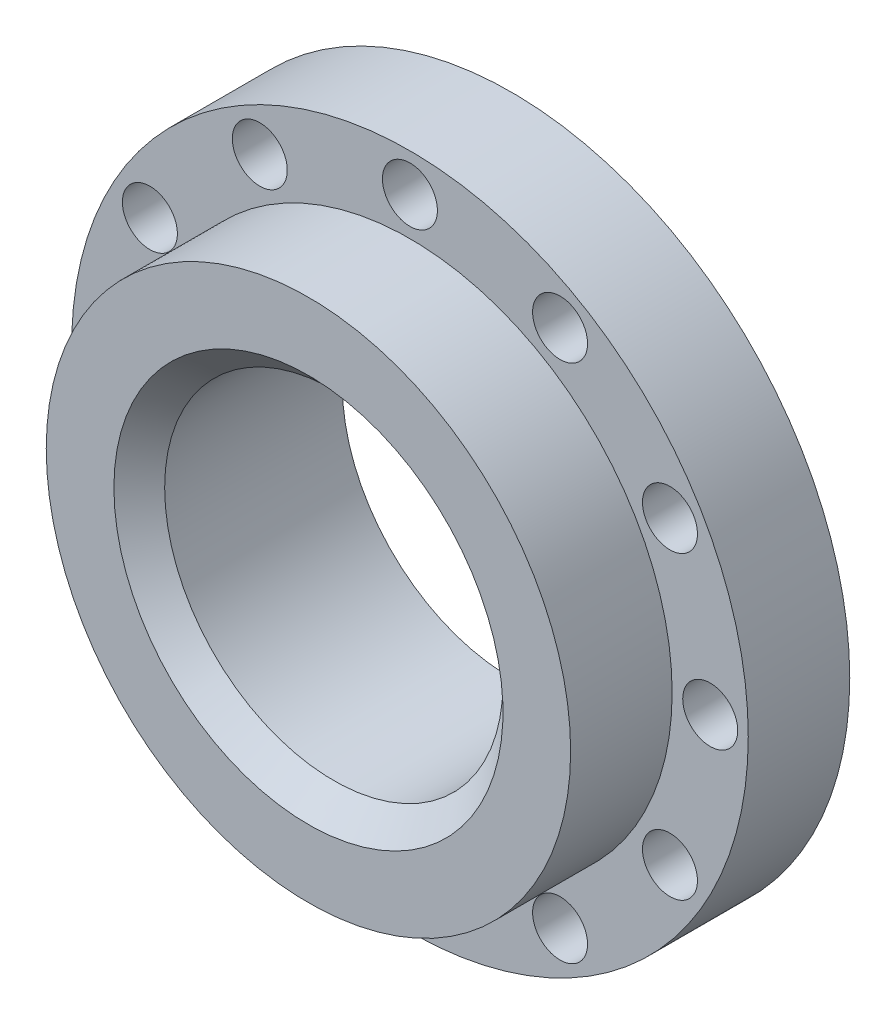
ISO-10303-21;
HEADER;
FILE_DESCRIPTION(('STEP AP214'),'2;1');
FILE_NAME('part.step','',(''),(''),'','','');
FILE_SCHEMA(('AUTOMOTIVE_DESIGN { 1 0 10303 214 1 1 1 1 }'));
ENDSEC;
DATA;
#1=APPLICATION_CONTEXT('core data for automotive mechanical design processes');
#2=APPLICATION_PROTOCOL_DEFINITION('international standard','automotive_design',2000,#1);
#3=PRODUCT_CONTEXT('',#1,'mechanical');
#4=PRODUCT('Part','Part','',(#3));
#5=PRODUCT_RELATED_PRODUCT_CATEGORY('part','',(#4));
#6=PRODUCT_DEFINITION_FORMATION('','',#4);
#7=PRODUCT_DEFINITION_CONTEXT('part definition',#1,'design');
#8=PRODUCT_DEFINITION('design','',#6,#7);
#9=PRODUCT_DEFINITION_SHAPE('','',#8);
#10=(LENGTH_UNIT() NAMED_UNIT(*) SI_UNIT(.MILLI.,.METRE.));
#11=(NAMED_UNIT(*) PLANE_ANGLE_UNIT() SI_UNIT($,.RADIAN.));
#12=(NAMED_UNIT(*) SI_UNIT($,.STERADIAN.) SOLID_ANGLE_UNIT());
#13=UNCERTAINTY_MEASURE_WITH_UNIT(LENGTH_MEASURE(1.E-05),#10,'distance_accuracy_value','');
#14=(GEOMETRIC_REPRESENTATION_CONTEXT(3) GLOBAL_UNCERTAINTY_ASSIGNED_CONTEXT((#13)) GLOBAL_UNIT_ASSIGNED_CONTEXT((#10,
#11,#12)) REPRESENTATION_CONTEXT('',''));
#15=CARTESIAN_POINT('',(0.,0.,0.));
#16=DIRECTION('',(0.,0.,1.));
#17=DIRECTION('',(1.,0.,0.));
#18=AXIS2_PLACEMENT_3D('',#15,#16,#17);
#19=CARTESIAN_POINT('',(0.,0.,-331.));
#20=DIRECTION('',(0.,0.,-1.));
#21=DIRECTION('',(-1.,0.,0.));
#22=AXIS2_PLACEMENT_3D('',#19,#20,#21);
#23=PLANE('',#22);
#24=CARTESIAN_POINT('',(30.7439018343476,17.7499999999999,-331.));
#25=DIRECTION('',(0.,0.,-1.));
#26=DIRECTION('',(-1.,0.,0.));
#27=AXIS2_PLACEMENT_3D('',#24,#25,#26);
#28=CIRCLE('',#27,3.24999999999999);
#29=CARTESIAN_POINT('',(27.4939018343476,17.7499999999999,-331.));
#30=VERTEX_POINT('',#29);
#31=EDGE_CURVE('E72',#30,#30,#28,.T.);
#32=ORIENTED_EDGE('',*,*,#31,.F.);
#33=EDGE_LOOP('',(#32));
#34=FACE_BOUND('',#33,.T.);
#35=CARTESIAN_POINT('',(35.5,-1.11022302462516E-13,-331.));
#36=DIRECTION('',(0.,0.,-1.));
#37=DIRECTION('',(-1.,0.,0.));
#38=AXIS2_PLACEMENT_3D('',#35,#36,#37);
#39=CIRCLE('',#38,3.24999999999999);
#40=CARTESIAN_POINT('',(32.25,-1.11022302462516E-13,-331.));
#41=VERTEX_POINT('',#40);
#42=EDGE_CURVE('E64',#41,#41,#39,.T.);
#43=ORIENTED_EDGE('',*,*,#42,.F.);
#44=EDGE_LOOP('',(#43));
#45=FACE_BOUND('',#44,.T.);
#46=CARTESIAN_POINT('',(30.7439018343475,-17.7500000000002,-331.));
#47=DIRECTION('',(0.,0.,-1.));
#48=DIRECTION('',(-1.,0.,0.));
#49=AXIS2_PLACEMENT_3D('',#46,#47,#48);
#50=CIRCLE('',#49,3.24999999999999);
#51=CARTESIAN_POINT('',(27.4939018343475,-17.7500000000002,-331.));
#52=VERTEX_POINT('',#51);
#53=EDGE_CURVE('E71',#52,#52,#50,.T.);
#54=ORIENTED_EDGE('',*,*,#53,.F.);
#55=EDGE_LOOP('',(#54));
#56=FACE_BOUND('',#55,.T.);
#57=CARTESIAN_POINT('',(17.7499999999998,-30.7439018343477,-331.));
#58=DIRECTION('',(0.,0.,-1.));
#59=DIRECTION('',(-1.,0.,0.));
#60=AXIS2_PLACEMENT_3D('',#57,#58,#59);
#61=CIRCLE('',#60,3.24999999999999);
#62=CARTESIAN_POINT('',(14.4999999999998,-30.7439018343477,-331.));
#63=VERTEX_POINT('',#62);
#64=EDGE_CURVE('E56',#63,#63,#61,.T.);
#65=ORIENTED_EDGE('',*,*,#64,.F.);
#66=EDGE_LOOP('',(#65));
#67=FACE_BOUND('',#66,.T.);
#68=CARTESIAN_POINT('',(0.,-35.5,-331.));
#69=DIRECTION('',(0.,0.,-1.));
#70=DIRECTION('',(-1.,0.,0.));
#71=AXIS2_PLACEMENT_3D('',#68,#69,#70);
#72=CIRCLE('',#71,3.24999999999999);
#73=CARTESIAN_POINT('',(-3.24999999999999,-35.5,-331.));
#74=VERTEX_POINT('',#73);
#75=EDGE_CURVE('E63',#74,#74,#72,.T.);
#76=ORIENTED_EDGE('',*,*,#75,.F.);
#77=EDGE_LOOP('',(#76));
#78=FACE_BOUND('',#77,.T.);
#79=CARTESIAN_POINT('',(-17.7500000000003,-30.7439018343474,-331.));
#80=DIRECTION('',(0.,0.,-1.));
#81=DIRECTION('',(-1.,0.,0.));
#82=AXIS2_PLACEMENT_3D('',#79,#80,#81);
#83=CIRCLE('',#82,3.24999999999999);
#84=CARTESIAN_POINT('',(-21.0000000000003,-30.7439018343474,-331.));
#85=VERTEX_POINT('',#84);
#86=EDGE_CURVE('E115',#85,#85,#83,.T.);
#87=ORIENTED_EDGE('',*,*,#86,.F.);
#88=EDGE_LOOP('',(#87));
#89=FACE_BOUND('',#88,.T.);
#90=CARTESIAN_POINT('',(-30.7439018343477,-17.7499999999997,-331.));
#91=DIRECTION('',(0.,0.,-1.));
#92=DIRECTION('',(-1.,0.,0.));
#93=AXIS2_PLACEMENT_3D('',#90,#91,#92);
#94=CIRCLE('',#93,3.24999999999999);
#95=CARTESIAN_POINT('',(-33.9939018343477,-17.7499999999997,-331.));
#96=VERTEX_POINT('',#95);
#97=EDGE_CURVE('E109',#96,#96,#94,.T.);
#98=ORIENTED_EDGE('',*,*,#97,.F.);
#99=EDGE_LOOP('',(#98));
#100=FACE_BOUND('',#99,.T.);
#101=CARTESIAN_POINT('',(-35.5,3.33066907387547E-13,-331.));
#102=DIRECTION('',(0.,0.,-1.));
#103=DIRECTION('',(-1.,0.,0.));
#104=AXIS2_PLACEMENT_3D('',#101,#102,#103);
#105=CIRCLE('',#104,3.24999999999999);
#106=CARTESIAN_POINT('',(-38.75,3.33066907387547E-13,-331.));
#107=VERTEX_POINT('',#106);
#108=EDGE_CURVE('E103',#107,#107,#105,.T.);
#109=ORIENTED_EDGE('',*,*,#108,.F.);
#110=EDGE_LOOP('',(#109));
#111=FACE_BOUND('',#110,.T.);
#112=CARTESIAN_POINT('',(-30.7439018343474,17.7500000000004,-331.));
#113=DIRECTION('',(0.,0.,-1.));
#114=DIRECTION('',(-1.,0.,0.));
#115=AXIS2_PLACEMENT_3D('',#112,#113,#114);
#116=CIRCLE('',#115,3.24999999999999);
#117=CARTESIAN_POINT('',(-33.9939018343474,17.7500000000004,-331.));
#118=VERTEX_POINT('',#117);
#119=EDGE_CURVE('E97',#118,#118,#116,.T.);
#120=ORIENTED_EDGE('',*,*,#119,.F.);
#121=EDGE_LOOP('',(#120));
#122=FACE_BOUND('',#121,.T.);
#123=CARTESIAN_POINT('',(-17.7499999999996,30.7439018343478,-331.));
#124=DIRECTION('',(0.,0.,-1.));
#125=DIRECTION('',(-1.,0.,0.));
#126=AXIS2_PLACEMENT_3D('',#123,#124,#125);
#127=CIRCLE('',#126,3.24999999999999);
#128=CARTESIAN_POINT('',(-20.9999999999996,30.7439018343478,-331.));
#129=VERTEX_POINT('',#128);
#130=EDGE_CURVE('E90',#129,#129,#127,.T.);
#131=ORIENTED_EDGE('',*,*,#130,.F.);
#132=EDGE_LOOP('',(#131));
#133=FACE_BOUND('',#132,.T.);
#134=CARTESIAN_POINT('',(17.75,30.7439018343476,-331.));
#135=DIRECTION('',(0.,0.,-1.));
#136=DIRECTION('',(-1.,0.,0.));
#137=AXIS2_PLACEMENT_3D('',#134,#135,#136);
#138=CIRCLE('',#137,3.24999999999999);
#139=CARTESIAN_POINT('',(14.5,30.7439018343476,-331.));
#140=VERTEX_POINT('',#139);
#141=EDGE_CURVE('E78',#140,#140,#138,.T.);
#142=ORIENTED_EDGE('',*,*,#141,.F.);
#143=EDGE_LOOP('',(#142));
#144=FACE_BOUND('',#143,.T.);
#145=CARTESIAN_POINT('',(0.,35.5,-331.));
#146=DIRECTION('',(0.,0.,-1.));
#147=DIRECTION('',(-1.,0.,0.));
#148=AXIS2_PLACEMENT_3D('',#145,#146,#147);
#149=CIRCLE('',#148,3.24999999999999);
#150=CARTESIAN_POINT('',(-3.24999999999999,35.5,-331.));
#151=VERTEX_POINT('',#150);
#152=EDGE_CURVE('E81',#151,#151,#149,.T.);
#153=ORIENTED_EDGE('',*,*,#152,.F.);
#154=EDGE_LOOP('',(#153));
#155=FACE_BOUND('',#154,.T.);
#156=CARTESIAN_POINT('',(0.,0.,-331.));
#157=DIRECTION('',(0.,0.,1.));
#158=DIRECTION('',(1.,0.,0.));
#159=AXIS2_PLACEMENT_3D('',#156,#157,#158);
#160=CIRCLE('',#159,19.9999999999999);
#161=CARTESIAN_POINT('',(19.9999999999999,0.,-331.));
#162=VERTEX_POINT('',#161);
#163=EDGE_CURVE('E89',#162,#162,#160,.T.);
#164=ORIENTED_EDGE('',*,*,#163,.T.);
#165=EDGE_LOOP('',(#164));
#166=FACE_BOUND('',#165,.T.);
#167=CARTESIAN_POINT('',(0.,0.,-331.));
#168=DIRECTION('',(0.,0.,1.));
#169=DIRECTION('',(1.,0.,0.));
#170=AXIS2_PLACEMENT_3D('',#167,#168,#169);
#171=CIRCLE('',#170,40.);
#172=CARTESIAN_POINT('',(40.,0.,-331.));
#173=VERTEX_POINT('',#172);
#174=EDGE_CURVE('E49',#173,#173,#171,.T.);
#175=ORIENTED_EDGE('',*,*,#174,.F.);
#176=EDGE_LOOP('',(#175));
#177=FACE_BOUND('',#176,.T.);
#178=ADVANCED_FACE('F38',(#34,#45,#56,#67,#78,#89,#100,#111,#122,#133,#144,#155,#166,#177),#23,.T.);
#179=CARTESIAN_POINT('',(0.,0.,0.));
#180=DIRECTION('',(0.,0.,1.));
#181=DIRECTION('',(1.,0.,0.));
#182=AXIS2_PLACEMENT_3D('',#179,#180,#181);
#183=CYLINDRICAL_SURFACE('',#182,40.);
#184=ORIENTED_EDGE('',*,*,#174,.T.);
#185=EDGE_LOOP('',(#184));
#186=FACE_BOUND('',#185,.T.);
#187=CARTESIAN_POINT('',(0.,0.,-319.));
#188=DIRECTION('',(0.,0.,1.));
#189=DIRECTION('',(1.,0.,0.));
#190=AXIS2_PLACEMENT_3D('',#187,#188,#189);
#191=CIRCLE('',#190,40.);
#192=CARTESIAN_POINT('',(40.,0.,-319.));
#193=VERTEX_POINT('',#192);
#194=EDGE_CURVE('E53',#193,#193,#191,.T.);
#195=ORIENTED_EDGE('',*,*,#194,.F.);
#196=EDGE_LOOP('',(#195));
#197=FACE_BOUND('',#196,.T.);
#198=ADVANCED_FACE('F157',(#186,#197),#183,.T.);
#199=CARTESIAN_POINT('',(0.,0.,-319.));
#200=DIRECTION('',(0.,0.,-1.));
#201=DIRECTION('',(-1.,0.,0.));
#202=AXIS2_PLACEMENT_3D('',#199,#200,#201);
#203=PLANE('',#202);
#204=CARTESIAN_POINT('',(30.7439018343476,17.7499999999999,-319.));
#205=DIRECTION('',(0.,0.,-1.));
#206=DIRECTION('',(-1.,0.,0.));
#207=AXIS2_PLACEMENT_3D('',#204,#205,#206);
#208=CIRCLE('',#207,3.24999999999999);
#209=CARTESIAN_POINT('',(27.4939018343476,17.7499999999999,-319.));
#210=VERTEX_POINT('',#209);
#211=EDGE_CURVE('E67',#210,#210,#208,.T.);
#212=ORIENTED_EDGE('',*,*,#211,.T.);
#213=EDGE_LOOP('',(#212));
#214=FACE_BOUND('',#213,.T.);
#215=CARTESIAN_POINT('',(35.5,-1.11022302462516E-13,-319.));
#216=DIRECTION('',(0.,0.,-1.));
#217=DIRECTION('',(-1.,0.,0.));
#218=AXIS2_PLACEMENT_3D('',#215,#216,#217);
#219=CIRCLE('',#218,3.24999999999999);
#220=CARTESIAN_POINT('',(32.25,-1.11022302462516E-13,-319.));
#221=VERTEX_POINT('',#220);
#222=EDGE_CURVE('E68',#221,#221,#219,.T.);
#223=ORIENTED_EDGE('',*,*,#222,.T.);
#224=EDGE_LOOP('',(#223));
#225=FACE_BOUND('',#224,.T.);
#226=CARTESIAN_POINT('',(30.7439018343475,-17.7500000000002,-319.));
#227=DIRECTION('',(0.,0.,-1.));
#228=DIRECTION('',(-1.,0.,0.));
#229=AXIS2_PLACEMENT_3D('',#226,#227,#228);
#230=CIRCLE('',#229,3.24999999999999);
#231=CARTESIAN_POINT('',(27.4939018343475,-17.7500000000002,-319.));
#232=VERTEX_POINT('',#231);
#233=EDGE_CURVE('E59',#232,#232,#230,.T.);
#234=ORIENTED_EDGE('',*,*,#233,.T.);
#235=EDGE_LOOP('',(#234));
#236=FACE_BOUND('',#235,.T.);
#237=CARTESIAN_POINT('',(17.7499999999998,-30.7439018343477,-319.));
#238=DIRECTION('',(0.,0.,-1.));
#239=DIRECTION('',(-1.,0.,0.));
#240=AXIS2_PLACEMENT_3D('',#237,#238,#239);
#241=CIRCLE('',#240,3.24999999999999);
#242=CARTESIAN_POINT('',(14.4999999999998,-30.7439018343477,-319.));
#243=VERTEX_POINT('',#242);
#244=EDGE_CURVE('E60',#243,#243,#241,.T.);
#245=ORIENTED_EDGE('',*,*,#244,.T.);
#246=EDGE_LOOP('',(#245));
#247=FACE_BOUND('',#246,.T.);
#248=CARTESIAN_POINT('',(0.,-35.5,-319.));
#249=DIRECTION('',(0.,0.,-1.));
#250=DIRECTION('',(-1.,0.,0.));
#251=AXIS2_PLACEMENT_3D('',#248,#249,#250);
#252=CIRCLE('',#251,3.24999999999999);
#253=CARTESIAN_POINT('',(-3.24999999999999,-35.5,-319.));
#254=VERTEX_POINT('',#253);
#255=EDGE_CURVE('E118',#254,#254,#252,.T.);
#256=ORIENTED_EDGE('',*,*,#255,.T.);
#257=EDGE_LOOP('',(#256));
#258=FACE_BOUND('',#257,.T.);
#259=CARTESIAN_POINT('',(-17.7500000000003,-30.7439018343474,-319.));
#260=DIRECTION('',(0.,0.,-1.));
#261=DIRECTION('',(-1.,0.,0.));
#262=AXIS2_PLACEMENT_3D('',#259,#260,#261);
#263=CIRCLE('',#262,3.24999999999999);
#264=CARTESIAN_POINT('',(-21.0000000000003,-30.7439018343474,-319.));
#265=VERTEX_POINT('',#264);
#266=EDGE_CURVE('E112',#265,#265,#263,.T.);
#267=ORIENTED_EDGE('',*,*,#266,.T.);
#268=EDGE_LOOP('',(#267));
#269=FACE_BOUND('',#268,.T.);
#270=CARTESIAN_POINT('',(-30.7439018343477,-17.7499999999997,-319.));
#271=DIRECTION('',(0.,0.,-1.));
#272=DIRECTION('',(-1.,0.,0.));
#273=AXIS2_PLACEMENT_3D('',#270,#271,#272);
#274=CIRCLE('',#273,3.24999999999999);
#275=CARTESIAN_POINT('',(-33.9939018343477,-17.7499999999997,-319.));
#276=VERTEX_POINT('',#275);
#277=EDGE_CURVE('E106',#276,#276,#274,.T.);
#278=ORIENTED_EDGE('',*,*,#277,.T.);
#279=EDGE_LOOP('',(#278));
#280=FACE_BOUND('',#279,.T.);
#281=CARTESIAN_POINT('',(-35.5,3.33066907387547E-13,-319.));
#282=DIRECTION('',(0.,0.,-1.));
#283=DIRECTION('',(-1.,0.,0.));
#284=AXIS2_PLACEMENT_3D('',#281,#282,#283);
#285=CIRCLE('',#284,3.24999999999999);
#286=CARTESIAN_POINT('',(-38.75,3.33066907387547E-13,-319.));
#287=VERTEX_POINT('',#286);
#288=EDGE_CURVE('E100',#287,#287,#285,.T.);
#289=ORIENTED_EDGE('',*,*,#288,.T.);
#290=EDGE_LOOP('',(#289));
#291=FACE_BOUND('',#290,.T.);
#292=CARTESIAN_POINT('',(-30.7439018343474,17.7500000000004,-319.));
#293=DIRECTION('',(0.,0.,-1.));
#294=DIRECTION('',(-1.,0.,0.));
#295=AXIS2_PLACEMENT_3D('',#292,#293,#294);
#296=CIRCLE('',#295,3.24999999999999);
#297=CARTESIAN_POINT('',(-33.9939018343474,17.7500000000004,-319.));
#298=VERTEX_POINT('',#297);
#299=EDGE_CURVE('E93',#298,#298,#296,.T.);
#300=ORIENTED_EDGE('',*,*,#299,.T.);
#301=EDGE_LOOP('',(#300));
#302=FACE_BOUND('',#301,.T.);
#303=CARTESIAN_POINT('',(-17.7499999999996,30.7439018343478,-319.));
#304=DIRECTION('',(0.,0.,-1.));
#305=DIRECTION('',(-1.,0.,0.));
#306=AXIS2_PLACEMENT_3D('',#303,#304,#305);
#307=CIRCLE('',#306,3.24999999999999);
#308=CARTESIAN_POINT('',(-20.9999999999996,30.7439018343478,-319.));
#309=VERTEX_POINT('',#308);
#310=EDGE_CURVE('E94',#309,#309,#307,.T.);
#311=ORIENTED_EDGE('',*,*,#310,.T.);
#312=EDGE_LOOP('',(#311));
#313=FACE_BOUND('',#312,.T.);
#314=CARTESIAN_POINT('',(17.75,30.7439018343476,-319.));
#315=DIRECTION('',(0.,0.,-1.));
#316=DIRECTION('',(-1.,0.,0.));
#317=AXIS2_PLACEMENT_3D('',#314,#315,#316);
#318=CIRCLE('',#317,3.24999999999999);
#319=CARTESIAN_POINT('',(14.5,30.7439018343476,-319.));
#320=VERTEX_POINT('',#319);
#321=EDGE_CURVE('E75',#320,#320,#318,.T.);
#322=ORIENTED_EDGE('',*,*,#321,.T.);
#323=EDGE_LOOP('',(#322));
#324=FACE_BOUND('',#323,.T.);
#325=CARTESIAN_POINT('',(0.,35.5,-319.));
#326=DIRECTION('',(0.,0.,-1.));
#327=DIRECTION('',(-1.,0.,0.));
#328=AXIS2_PLACEMENT_3D('',#325,#326,#327);
#329=CIRCLE('',#328,3.24999999999999);
#330=CARTESIAN_POINT('',(-3.24999999999999,35.5,-319.));
#331=VERTEX_POINT('',#330);
#332=EDGE_CURVE('E86',#331,#331,#329,.T.);
#333=ORIENTED_EDGE('',*,*,#332,.T.);
#334=EDGE_LOOP('',(#333));
#335=FACE_BOUND('',#334,.T.);
#336=CARTESIAN_POINT('',(0.,0.,-319.));
#337=DIRECTION('',(0.,0.,1.));
#338=DIRECTION('',(1.,0.,0.));
#339=AXIS2_PLACEMENT_3D('',#336,#337,#338);
#340=CIRCLE('',#339,31.);
#341=CARTESIAN_POINT('',(31.,0.,-319.));
#342=VERTEX_POINT('',#341);
#343=EDGE_CURVE('E131',#342,#342,#340,.T.);
#344=ORIENTED_EDGE('',*,*,#343,.F.);
#345=EDGE_LOOP('',(#344));
#346=FACE_BOUND('',#345,.T.);
#347=ORIENTED_EDGE('',*,*,#194,.T.);
#348=EDGE_LOOP('',(#347));
#349=FACE_BOUND('',#348,.T.);
#350=ADVANCED_FACE('F163',(#214,#225,#236,#247,#258,#269,#280,#291,#302,#313,#324,#335,#346,
#349),#203,.F.);
#351=CARTESIAN_POINT('',(0.,0.,0.));
#352=DIRECTION('',(0.,0.,1.));
#353=DIRECTION('',(1.,0.,0.));
#354=AXIS2_PLACEMENT_3D('',#351,#352,#353);
#355=CYLINDRICAL_SURFACE('',#354,31.);
#356=ORIENTED_EDGE('',*,*,#343,.T.);
#357=EDGE_LOOP('',(#356));
#358=FACE_BOUND('',#357,.T.);
#359=CARTESIAN_POINT('',(0.,0.,-307.));
#360=DIRECTION('',(0.,0.,1.));
#361=DIRECTION('',(1.,0.,0.));
#362=AXIS2_PLACEMENT_3D('',#359,#360,#361);
#363=CIRCLE('',#362,31.);
#364=CARTESIAN_POINT('',(31.,0.,-307.));
#365=VERTEX_POINT('',#364);
#366=EDGE_CURVE('E134',#365,#365,#363,.T.);
#367=ORIENTED_EDGE('',*,*,#366,.F.);
#368=EDGE_LOOP('',(#367));
#369=FACE_BOUND('',#368,.T.);
#370=ADVANCED_FACE('F154',(#358,#369),#355,.T.);
#371=CARTESIAN_POINT('',(0.,0.,-307.));
#372=DIRECTION('',(0.,0.,-1.));
#373=DIRECTION('',(-1.,0.,0.));
#374=AXIS2_PLACEMENT_3D('',#371,#372,#373);
#375=PLANE('',#374);
#376=CARTESIAN_POINT('',(0.,0.,-307.));
#377=DIRECTION('',(0.,0.,-1.));
#378=DIRECTION('',(-1.,0.,0.));
#379=AXIS2_PLACEMENT_3D('',#376,#377,#378);
#380=CIRCLE('',#379,22.9999999999999);
#381=CARTESIAN_POINT('',(-22.9999999999999,0.,-307.));
#382=VERTEX_POINT('',#381);
#383=EDGE_CURVE('E11',#382,#382,#380,.T.);
#384=ORIENTED_EDGE('',*,*,#383,.T.);
#385=EDGE_LOOP('',(#384));
#386=FACE_BOUND('',#385,.T.);
#387=ORIENTED_EDGE('',*,*,#366,.T.);
#388=EDGE_LOOP('',(#387));
#389=FACE_BOUND('',#388,.T.);
#390=ADVANCED_FACE('F145',(#386,#389),#375,.F.);
#391=CARTESIAN_POINT('',(0.,0.,0.));
#392=DIRECTION('',(0.,0.,1.));
#393=DIRECTION('',(1.,0.,0.));
#394=AXIS2_PLACEMENT_3D('',#391,#392,#393);
#395=CYLINDRICAL_SURFACE('',#394,19.9999999999999);
#396=CARTESIAN_POINT('',(0.,0.,-310.));
#397=DIRECTION('',(0.,0.,-1.));
#398=DIRECTION('',(-1.,0.,0.));
#399=AXIS2_PLACEMENT_3D('',#396,#397,#398);
#400=CIRCLE('',#399,19.9999999999999);
#401=CARTESIAN_POINT('',(-19.9999999999999,0.,-310.));
#402=VERTEX_POINT('',#401);
#403=EDGE_CURVE('E45',#402,#402,#400,.F.);
#404=ORIENTED_EDGE('',*,*,#403,.T.);
#405=EDGE_LOOP('',(#404));
#406=FACE_BOUND('',#405,.T.);
#407=ORIENTED_EDGE('',*,*,#163,.F.);
#408=EDGE_LOOP('',(#407));
#409=FACE_BOUND('',#408,.T.);
#410=ADVANCED_FACE('F142',(#406,#409),#395,.F.);
#411=CARTESIAN_POINT('',(0.,35.5,-331.));
#412=DIRECTION('',(0.,0.,-1.));
#413=DIRECTION('',(-1.,0.,0.));
#414=AXIS2_PLACEMENT_3D('',#411,#412,#413);
#415=CYLINDRICAL_SURFACE('',#414,3.24999999999999);
#416=ORIENTED_EDGE('',*,*,#332,.F.);
#417=EDGE_LOOP('',(#416));
#418=FACE_BOUND('',#417,.T.);
#419=ORIENTED_EDGE('',*,*,#152,.T.);
#420=EDGE_LOOP('',(#419));
#421=FACE_BOUND('',#420,.T.);
#422=ADVANCED_FACE('F144',(#418,#421),#415,.F.);
#423=CARTESIAN_POINT('',(17.75,30.7439018343476,-331.));
#424=DIRECTION('',(0.,0.,-1.));
#425=DIRECTION('',(-0.866025403784438,0.500000000000001,0.));
#426=AXIS2_PLACEMENT_3D('',#423,#424,#425);
#427=CYLINDRICAL_SURFACE('',#426,3.24999999999999);
#428=ORIENTED_EDGE('',*,*,#321,.F.);
#429=EDGE_LOOP('',(#428));
#430=FACE_BOUND('',#429,.T.);
#431=ORIENTED_EDGE('',*,*,#141,.T.);
#432=EDGE_LOOP('',(#431));
#433=FACE_BOUND('',#432,.T.);
#434=ADVANCED_FACE('F151',(#430,#433),#427,.F.);
#435=CARTESIAN_POINT('',(-17.7499999999996,30.7439018343478,-331.));
#436=DIRECTION('',(0.,0.,-1.));
#437=DIRECTION('',(-0.866025403784445,-0.499999999999989,0.));
#438=AXIS2_PLACEMENT_3D('',#435,#436,#437);
#439=CYLINDRICAL_SURFACE('',#438,3.24999999999999);
#440=ORIENTED_EDGE('',*,*,#310,.F.);
#441=EDGE_LOOP('',(#440));
#442=FACE_BOUND('',#441,.T.);
#443=ORIENTED_EDGE('',*,*,#130,.T.);
#444=EDGE_LOOP('',(#443));
#445=FACE_BOUND('',#444,.T.);
#446=ADVANCED_FACE('F188',(#442,#445),#439,.F.);
#447=CARTESIAN_POINT('',(-30.7439018343474,17.7500000000004,-331.));
#448=DIRECTION('',(0.,0.,-1.));
#449=DIRECTION('',(-0.50000000000001,-0.866025403784433,0.));
#450=AXIS2_PLACEMENT_3D('',#447,#448,#449);
#451=CYLINDRICAL_SURFACE('',#450,3.24999999999999);
#452=ORIENTED_EDGE('',*,*,#299,.F.);
#453=EDGE_LOOP('',(#452));
#454=FACE_BOUND('',#453,.T.);
#455=ORIENTED_EDGE('',*,*,#119,.T.);
#456=EDGE_LOOP('',(#455));
#457=FACE_BOUND('',#456,.T.);
#458=ADVANCED_FACE('F193',(#454,#457),#451,.F.);
#459=CARTESIAN_POINT('',(-35.5,3.33066907387547E-13,-331.));
#460=DIRECTION('',(0.,0.,-1.));
#461=DIRECTION('',(0.,-1.,0.));
#462=AXIS2_PLACEMENT_3D('',#459,#460,#461);
#463=CYLINDRICAL_SURFACE('',#462,3.24999999999999);
#464=ORIENTED_EDGE('',*,*,#288,.F.);
#465=EDGE_LOOP('',(#464));
#466=FACE_BOUND('',#465,.T.);
#467=ORIENTED_EDGE('',*,*,#108,.T.);
#468=EDGE_LOOP('',(#467));
#469=FACE_BOUND('',#468,.T.);
#470=ADVANCED_FACE('F197',(#466,#469),#463,.F.);
#471=CARTESIAN_POINT('',(-30.7439018343477,-17.7499999999997,-331.));
#472=DIRECTION('',(0.,0.,-1.));
#473=DIRECTION('',(0.499999999999992,-0.866025403784443,0.));
#474=AXIS2_PLACEMENT_3D('',#471,#472,#473);
#475=CYLINDRICAL_SURFACE('',#474,3.24999999999999);
#476=ORIENTED_EDGE('',*,*,#277,.F.);
#477=EDGE_LOOP('',(#476));
#478=FACE_BOUND('',#477,.T.);
#479=ORIENTED_EDGE('',*,*,#97,.T.);
#480=EDGE_LOOP('',(#479));
#481=FACE_BOUND('',#480,.T.);
#482=ADVANCED_FACE('F201',(#478,#481),#475,.F.);
#483=CARTESIAN_POINT('',(-17.7500000000003,-30.7439018343474,-331.));
#484=DIRECTION('',(0.,0.,-1.));
#485=DIRECTION('',(0.866025403784435,-0.500000000000007,0.));
#486=AXIS2_PLACEMENT_3D('',#483,#484,#485);
#487=CYLINDRICAL_SURFACE('',#486,3.24999999999999);
#488=ORIENTED_EDGE('',*,*,#266,.F.);
#489=EDGE_LOOP('',(#488));
#490=FACE_BOUND('',#489,.T.);
#491=ORIENTED_EDGE('',*,*,#86,.T.);
#492=EDGE_LOOP('',(#491));
#493=FACE_BOUND('',#492,.T.);
#494=ADVANCED_FACE('F205',(#490,#493),#487,.F.);
#495=CARTESIAN_POINT('',(0.,-35.5,-331.));
#496=DIRECTION('',(0.,0.,-1.));
#497=DIRECTION('',(1.,0.,0.));
#498=AXIS2_PLACEMENT_3D('',#495,#496,#497);
#499=CYLINDRICAL_SURFACE('',#498,3.24999999999999);
#500=ORIENTED_EDGE('',*,*,#255,.F.);
#501=EDGE_LOOP('',(#500));
#502=FACE_BOUND('',#501,.T.);
#503=ORIENTED_EDGE('',*,*,#75,.T.);
#504=EDGE_LOOP('',(#503));
#505=FACE_BOUND('',#504,.T.);
#506=ADVANCED_FACE('F178',(#502,#505),#499,.F.);
#507=CARTESIAN_POINT('',(17.7499999999998,-30.7439018343477,-331.));
#508=DIRECTION('',(0.,0.,-1.));
#509=DIRECTION('',(0.866025403784442,0.499999999999995,0.));
#510=AXIS2_PLACEMENT_3D('',#507,#508,#509);
#511=CYLINDRICAL_SURFACE('',#510,3.24999999999999);
#512=ORIENTED_EDGE('',*,*,#244,.F.);
#513=EDGE_LOOP('',(#512));
#514=FACE_BOUND('',#513,.T.);
#515=ORIENTED_EDGE('',*,*,#64,.T.);
#516=EDGE_LOOP('',(#515));
#517=FACE_BOUND('',#516,.T.);
#518=ADVANCED_FACE('F174',(#514,#517),#511,.F.);
#519=CARTESIAN_POINT('',(30.7439018343475,-17.7500000000002,-331.));
#520=DIRECTION('',(0.,0.,-1.));
#521=DIRECTION('',(0.500000000000004,0.866025403784436,0.));
#522=AXIS2_PLACEMENT_3D('',#519,#520,#521);
#523=CYLINDRICAL_SURFACE('',#522,3.24999999999999);
#524=ORIENTED_EDGE('',*,*,#233,.F.);
#525=EDGE_LOOP('',(#524));
#526=FACE_BOUND('',#525,.T.);
#527=ORIENTED_EDGE('',*,*,#53,.T.);
#528=EDGE_LOOP('',(#527));
#529=FACE_BOUND('',#528,.T.);
#530=ADVANCED_FACE('F170',(#526,#529),#523,.F.);
#531=CARTESIAN_POINT('',(35.5,-1.11022302462516E-13,-331.));
#532=DIRECTION('',(0.,0.,-1.));
#533=DIRECTION('',(0.,1.,0.));
#534=AXIS2_PLACEMENT_3D('',#531,#532,#533);
#535=CYLINDRICAL_SURFACE('',#534,3.24999999999999);
#536=ORIENTED_EDGE('',*,*,#222,.F.);
#537=EDGE_LOOP('',(#536));
#538=FACE_BOUND('',#537,.T.);
#539=ORIENTED_EDGE('',*,*,#42,.T.);
#540=EDGE_LOOP('',(#539));
#541=FACE_BOUND('',#540,.T.);
#542=ADVANCED_FACE('F173',(#538,#541),#535,.F.);
#543=CARTESIAN_POINT('',(30.7439018343476,17.7499999999999,-331.));
#544=DIRECTION('',(0.,0.,-1.));
#545=DIRECTION('',(-0.499999999999998,0.86602540378444,0.));
#546=AXIS2_PLACEMENT_3D('',#543,#544,#545);
#547=CYLINDRICAL_SURFACE('',#546,3.24999999999999);
#548=ORIENTED_EDGE('',*,*,#211,.F.);
#549=EDGE_LOOP('',(#548));
#550=FACE_BOUND('',#549,.T.);
#551=ORIENTED_EDGE('',*,*,#31,.T.);
#552=EDGE_LOOP('',(#551));
#553=FACE_BOUND('',#552,.T.);
#554=ADVANCED_FACE('F182',(#550,#553),#547,.F.);
#555=CARTESIAN_POINT('',(0.,0.,-310.));
#556=DIRECTION('',(0.,0.,1.));
#557=DIRECTION('',(1.,0.,0.));
#558=AXIS2_PLACEMENT_3D('',#555,#556,#557);
#559=CONICAL_SURFACE('',#558,19.9999999999999,0.785398163397445);
#560=ORIENTED_EDGE('',*,*,#383,.F.);
#561=EDGE_LOOP('',(#560));
#562=FACE_BOUND('',#561,.T.);
#563=ORIENTED_EDGE('',*,*,#403,.F.);
#564=EDGE_LOOP('',(#563));
#565=FACE_BOUND('',#564,.T.);
#566=ADVANCED_FACE('F40',(#562,#565),#559,.F.);
#567=CLOSED_SHELL('',(#178,#198,#350,#370,#390,#410,#422,#434,#446,#458,#470,#482,#494,#506,
#518,#530,#542,#554,#566));
#568=MANIFOLD_SOLID_BREP('B2',#567);
#569=ADVANCED_BREP_SHAPE_REPRESENTATION('',(#18,#568),#14);
#570=SHAPE_DEFINITION_REPRESENTATION(#9,#569);
ENDSEC;
END-ISO-10303-21;
